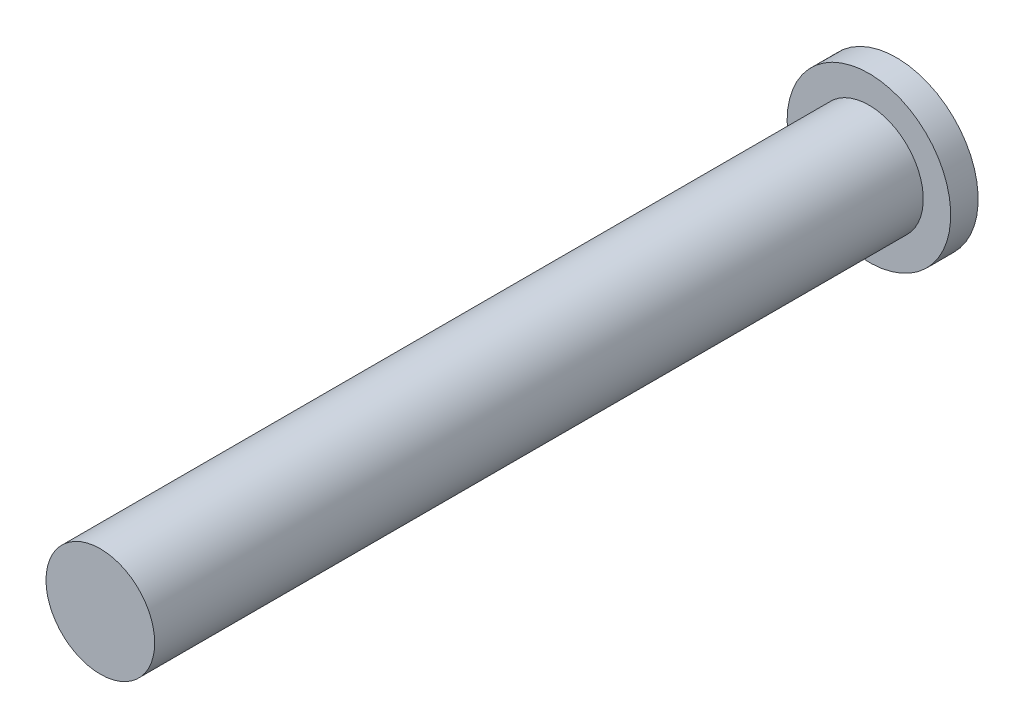
ISO-10303-21;
HEADER;
FILE_DESCRIPTION(('STEP AP214'),'2;1');
FILE_NAME('part.step','',(''),(''),'','','');
FILE_SCHEMA(('AUTOMOTIVE_DESIGN { 1 0 10303 214 1 1 1 1 }'));
ENDSEC;
DATA;
#1=APPLICATION_CONTEXT('core data for automotive mechanical design processes');
#2=APPLICATION_PROTOCOL_DEFINITION('international standard','automotive_design',2000,#1);
#3=PRODUCT_CONTEXT('',#1,'mechanical');
#4=PRODUCT('Part','Part','',(#3));
#5=PRODUCT_RELATED_PRODUCT_CATEGORY('part','',(#4));
#6=PRODUCT_DEFINITION_FORMATION('','',#4);
#7=PRODUCT_DEFINITION_CONTEXT('part definition',#1,'design');
#8=PRODUCT_DEFINITION('design','',#6,#7);
#9=PRODUCT_DEFINITION_SHAPE('','',#8);
#10=(LENGTH_UNIT() NAMED_UNIT(*) SI_UNIT(.MILLI.,.METRE.));
#11=(NAMED_UNIT(*) PLANE_ANGLE_UNIT() SI_UNIT($,.RADIAN.));
#12=(NAMED_UNIT(*) SI_UNIT($,.STERADIAN.) SOLID_ANGLE_UNIT());
#13=UNCERTAINTY_MEASURE_WITH_UNIT(LENGTH_MEASURE(1.E-05),#10,'distance_accuracy_value','');
#14=(GEOMETRIC_REPRESENTATION_CONTEXT(3) GLOBAL_UNCERTAINTY_ASSIGNED_CONTEXT((#13)) GLOBAL_UNIT_ASSIGNED_CONTEXT((#10,
#11,#12)) REPRESENTATION_CONTEXT('',''));
#15=CARTESIAN_POINT('',(0.,0.,0.));
#16=DIRECTION('',(0.,0.,1.));
#17=DIRECTION('',(1.,0.,0.));
#18=AXIS2_PLACEMENT_3D('',#15,#16,#17);
#19=CARTESIAN_POINT('',(0.,0.,70.));
#20=DIRECTION('',(0.,0.,-1.));
#21=DIRECTION('',(-1.,0.,0.));
#22=AXIS2_PLACEMENT_3D('',#19,#20,#21);
#23=CYLINDRICAL_SURFACE('',#22,4.95);
#24=CARTESIAN_POINT('',(0.,0.,70.));
#25=DIRECTION('',(0.,0.,1.));
#26=DIRECTION('',(1.,0.,0.));
#27=AXIS2_PLACEMENT_3D('',#24,#25,#26);
#28=CIRCLE('',#27,4.95);
#29=CARTESIAN_POINT('',(4.95,0.,70.));
#30=VERTEX_POINT('',#29);
#31=EDGE_CURVE('E10',#30,#30,#28,.T.);
#32=ORIENTED_EDGE('',*,*,#31,.F.);
#33=EDGE_LOOP('',(#32));
#34=FACE_BOUND('',#33,.T.);
#35=CARTESIAN_POINT('',(0.,0.,0.));
#36=DIRECTION('',(0.,0.,-1.));
#37=DIRECTION('',(-1.,0.,0.));
#38=AXIS2_PLACEMENT_3D('',#35,#36,#37);
#39=CIRCLE('',#38,4.95);
#40=CARTESIAN_POINT('',(-4.95,0.,0.));
#41=VERTEX_POINT('',#40);
#42=EDGE_CURVE('E43',#41,#41,#39,.T.);
#43=ORIENTED_EDGE('',*,*,#42,.F.);
#44=EDGE_LOOP('',(#43));
#45=FACE_BOUND('',#44,.T.);
#46=ADVANCED_FACE('F36',(#34,#45),#23,.T.);
#47=CARTESIAN_POINT('',(0.,0.,70.));
#48=DIRECTION('',(0.,0.,1.));
#49=DIRECTION('',(1.,0.,0.));
#50=AXIS2_PLACEMENT_3D('',#47,#48,#49);
#51=PLANE('',#50);
#52=ORIENTED_EDGE('',*,*,#31,.T.);
#53=EDGE_LOOP('',(#52));
#54=FACE_BOUND('',#53,.T.);
#55=ADVANCED_FACE('F76',(#54),#51,.T.);
#56=CARTESIAN_POINT('',(0.,0.,-2.5));
#57=DIRECTION('',(0.,0.,1.));
#58=DIRECTION('',(1.,0.,0.));
#59=AXIS2_PLACEMENT_3D('',#56,#57,#58);
#60=CYLINDRICAL_SURFACE('',#59,7.45);
#61=CARTESIAN_POINT('',(0.,0.,-2.5));
#62=DIRECTION('',(0.,0.,-1.));
#63=DIRECTION('',(-1.,0.,0.));
#64=AXIS2_PLACEMENT_3D('',#61,#62,#63);
#65=CIRCLE('',#64,7.45);
#66=CARTESIAN_POINT('',(-7.45,0.,-2.5));
#67=VERTEX_POINT('',#66);
#68=EDGE_CURVE('E49',#67,#67,#65,.T.);
#69=ORIENTED_EDGE('',*,*,#68,.F.);
#70=EDGE_LOOP('',(#69));
#71=FACE_BOUND('',#70,.T.);
#72=CARTESIAN_POINT('',(0.,0.,0.));
#73=DIRECTION('',(0.,0.,-1.));
#74=DIRECTION('',(-1.,0.,0.));
#75=AXIS2_PLACEMENT_3D('',#72,#73,#74);
#76=CIRCLE('',#75,7.45);
#77=CARTESIAN_POINT('',(-7.45,0.,0.));
#78=VERTEX_POINT('',#77);
#79=EDGE_CURVE('E55',#78,#78,#76,.T.);
#80=ORIENTED_EDGE('',*,*,#79,.T.);
#81=EDGE_LOOP('',(#80));
#82=FACE_BOUND('',#81,.T.);
#83=ADVANCED_FACE('F63',(#71,#82),#60,.T.);
#84=CARTESIAN_POINT('',(0.,0.,-2.5));
#85=DIRECTION('',(0.,0.,-1.));
#86=DIRECTION('',(-1.,0.,0.));
#87=AXIS2_PLACEMENT_3D('',#84,#85,#86);
#88=PLANE('',#87);
#89=ORIENTED_EDGE('',*,*,#68,.T.);
#90=EDGE_LOOP('',(#89));
#91=FACE_BOUND('',#90,.T.);
#92=ADVANCED_FACE('F67',(#91),#88,.T.);
#93=CARTESIAN_POINT('',(0.,0.,0.));
#94=DIRECTION('',(0.,0.,-1.));
#95=DIRECTION('',(-1.,0.,0.));
#96=AXIS2_PLACEMENT_3D('',#93,#94,#95);
#97=PLANE('',#96);
#98=ORIENTED_EDGE('',*,*,#42,.T.);
#99=EDGE_LOOP('',(#98));
#100=FACE_BOUND('',#99,.T.);
#101=ORIENTED_EDGE('',*,*,#79,.F.);
#102=EDGE_LOOP('',(#101));
#103=FACE_BOUND('',#102,.T.);
#104=ADVANCED_FACE('F65',(#100,#103),#97,.F.);
#105=CLOSED_SHELL('',(#46,#55,#83,#92,#104));
#106=MANIFOLD_SOLID_BREP('B2',#105);
#107=ADVANCED_BREP_SHAPE_REPRESENTATION('',(#18,#106),#14);
#108=SHAPE_DEFINITION_REPRESENTATION(#9,#107);
ENDSEC;
END-ISO-10303-21;
